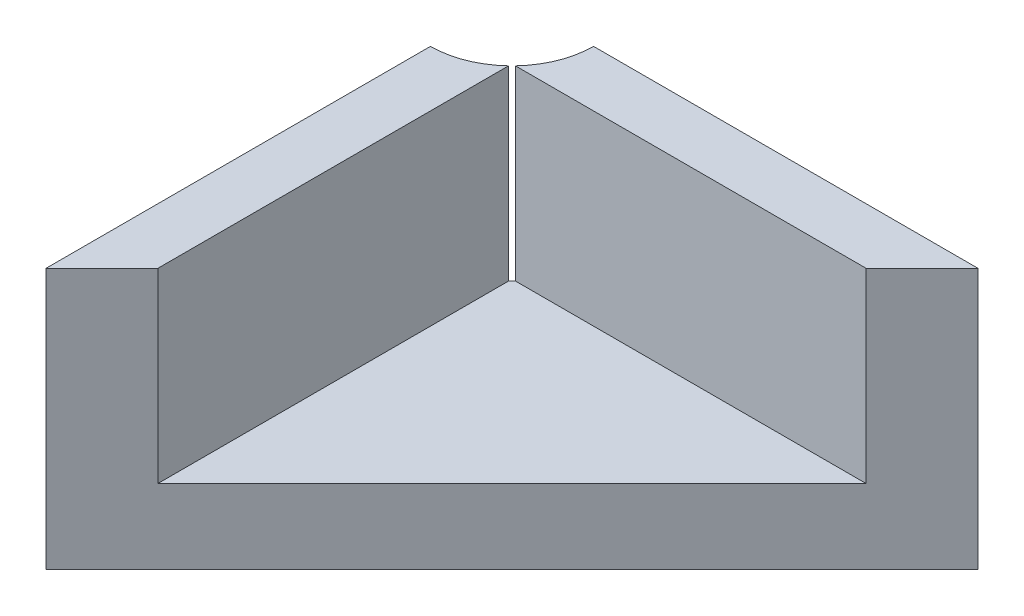
ISO-10303-21;
HEADER;
FILE_DESCRIPTION(('STEP AP214'),'2;1');
FILE_NAME('part.step','',(''),(''),'','','');
FILE_SCHEMA(('AUTOMOTIVE_DESIGN { 1 0 10303 214 1 1 1 1 }'));
ENDSEC;
DATA;
#1=APPLICATION_CONTEXT('core data for automotive mechanical design processes');
#2=APPLICATION_PROTOCOL_DEFINITION('international standard','automotive_design',2000,#1);
#3=PRODUCT_CONTEXT('',#1,'mechanical');
#4=PRODUCT('Part','Part','',(#3));
#5=PRODUCT_RELATED_PRODUCT_CATEGORY('part','',(#4));
#6=PRODUCT_DEFINITION_FORMATION('','',#4);
#7=PRODUCT_DEFINITION_CONTEXT('part definition',#1,'design');
#8=PRODUCT_DEFINITION('design','',#6,#7);
#9=PRODUCT_DEFINITION_SHAPE('','',#8);
#10=(LENGTH_UNIT() NAMED_UNIT(*) SI_UNIT(.MILLI.,.METRE.));
#11=(NAMED_UNIT(*) PLANE_ANGLE_UNIT() SI_UNIT($,.RADIAN.));
#12=(NAMED_UNIT(*) SI_UNIT($,.STERADIAN.) SOLID_ANGLE_UNIT());
#13=UNCERTAINTY_MEASURE_WITH_UNIT(LENGTH_MEASURE(1.E-05),#10,'distance_accuracy_value','');
#14=(GEOMETRIC_REPRESENTATION_CONTEXT(3) GLOBAL_UNCERTAINTY_ASSIGNED_CONTEXT((#13)) GLOBAL_UNIT_ASSIGNED_CONTEXT((#10,
#11,#12)) REPRESENTATION_CONTEXT('',''));
#15=CARTESIAN_POINT('',(0.,0.,0.));
#16=DIRECTION('',(0.,0.,1.));
#17=DIRECTION('',(1.,0.,0.));
#18=AXIS2_PLACEMENT_3D('',#15,#16,#17);
#19=CARTESIAN_POINT('',(0.,5.6,0.));
#20=DIRECTION('',(0.,1.,0.));
#21=DIRECTION('',(0.,0.,1.));
#22=AXIS2_PLACEMENT_3D('',#19,#20,#21);
#23=PLANE('',#22);
#24=CARTESIAN_POINT('',(-5.,5.6,-5.));
#25=DIRECTION('',(0.,-1.,0.));
#26=DIRECTION('',(0.,0.,-1.));
#27=AXIS2_PLACEMENT_3D('',#24,#25,#26);
#28=CIRCLE('',#27,1.75);
#29=CARTESIAN_POINT('',(-3.8,5.6,-3.7262260797143));
#30=VERTEX_POINT('',#29);
#31=CARTESIAN_POINT('',(-5.,5.6,-3.25));
#32=VERTEX_POINT('',#31);
#33=EDGE_CURVE('E135',#30,#32,#28,.T.);
#34=ORIENTED_EDGE('',*,*,#33,.T.);
#35=DIRECTION('',(0.,0.,1.));
#36=VECTOR('',#35,1.);
#37=CARTESIAN_POINT('',(-5.,5.6,-5.));
#38=LINE('',#37,#36);
#39=CARTESIAN_POINT('',(-5.,5.6,5.));
#40=VERTEX_POINT('',#39);
#41=EDGE_CURVE('E151',#32,#40,#38,.T.);
#42=ORIENTED_EDGE('',*,*,#41,.T.);
#43=DIRECTION('',(0.707106781186547,0.,-0.707106781186548));
#44=VECTOR('',#43,1.);
#45=CARTESIAN_POINT('',(5.,5.6,-5.));
#46=LINE('',#45,#44);
#47=CARTESIAN_POINT('',(-3.8,5.6,3.8));
#48=VERTEX_POINT('',#47);
#49=EDGE_CURVE('E178',#40,#48,#46,.T.);
#50=ORIENTED_EDGE('',*,*,#49,.T.);
#51=DIRECTION('',(0.,0.,1.));
#52=VECTOR('',#51,1.);
#53=CARTESIAN_POINT('',(-3.8,5.6,0.));
#54=LINE('',#53,#52);
#55=EDGE_CURVE('E174',#30,#48,#54,.T.);
#56=ORIENTED_EDGE('',*,*,#55,.F.);
#57=EDGE_LOOP('',(#34,#42,#50,#56));
#58=FACE_BOUND('',#57,.T.);
#59=ADVANCED_FACE('F61',(#58),#23,.T.);
#60=CARTESIAN_POINT('',(-5.,1.6,-5.));
#61=DIRECTION('',(1.,0.,0.));
#62=DIRECTION('',(0.,0.,-1.));
#63=AXIS2_PLACEMENT_3D('',#60,#61,#62);
#64=PLANE('',#63);
#65=ORIENTED_EDGE('',*,*,#41,.F.);
#66=DIRECTION('',(0.,-1.,0.));
#67=VECTOR('',#66,1.);
#68=CARTESIAN_POINT('',(-5.,5.6,-3.25));
#69=LINE('',#68,#67);
#70=CARTESIAN_POINT('',(-5.,0.,-3.25));
#71=VERTEX_POINT('',#70);
#72=EDGE_CURVE('E145',#32,#71,#69,.T.);
#73=ORIENTED_EDGE('',*,*,#72,.T.);
#74=DIRECTION('',(0.,0.,1.));
#75=VECTOR('',#74,1.);
#76=CARTESIAN_POINT('',(-5.,0.,-5.));
#77=LINE('',#76,#75);
#78=CARTESIAN_POINT('',(-5.,0.,5.));
#79=VERTEX_POINT('',#78);
#80=EDGE_CURVE('E150',#71,#79,#77,.T.);
#81=ORIENTED_EDGE('',*,*,#80,.T.);
#82=DIRECTION('',(0.,-1.,0.));
#83=VECTOR('',#82,1.);
#84=CARTESIAN_POINT('',(-5.,1.6,5.));
#85=LINE('',#84,#83);
#86=EDGE_CURVE('E161',#40,#79,#85,.T.);
#87=ORIENTED_EDGE('',*,*,#86,.F.);
#88=EDGE_LOOP('',(#65,#73,#81,#87));
#89=FACE_BOUND('',#88,.T.);
#90=ADVANCED_FACE('F63',(#89),#64,.F.);
#91=CARTESIAN_POINT('',(5.,1.6,-5.));
#92=DIRECTION('',(0.,0.,1.));
#93=DIRECTION('',(1.,0.,0.));
#94=AXIS2_PLACEMENT_3D('',#91,#92,#93);
#95=PLANE('',#94);
#96=DIRECTION('',(-1.,0.,0.));
#97=VECTOR('',#96,1.);
#98=CARTESIAN_POINT('',(5.,0.,-5.));
#99=LINE('',#98,#97);
#100=CARTESIAN_POINT('',(5.,0.,-5.));
#101=VERTEX_POINT('',#100);
#102=CARTESIAN_POINT('',(-3.25,0.,-5.));
#103=VERTEX_POINT('',#102);
#104=EDGE_CURVE('E144',#101,#103,#99,.T.);
#105=ORIENTED_EDGE('',*,*,#104,.T.);
#106=DIRECTION('',(0.,-1.,0.));
#107=VECTOR('',#106,1.);
#108=CARTESIAN_POINT('',(-3.25,5.6,-5.));
#109=LINE('',#108,#107);
#110=CARTESIAN_POINT('',(-3.25,5.6,-5.));
#111=VERTEX_POINT('',#110);
#112=EDGE_CURVE('E127',#103,#111,#109,.F.);
#113=ORIENTED_EDGE('',*,*,#112,.T.);
#114=DIRECTION('',(-1.,0.,0.));
#115=VECTOR('',#114,1.);
#116=CARTESIAN_POINT('',(5.,5.6,-5.));
#117=LINE('',#116,#115);
#118=CARTESIAN_POINT('',(5.,5.6,-5.));
#119=VERTEX_POINT('',#118);
#120=EDGE_CURVE('E142',#119,#111,#117,.T.);
#121=ORIENTED_EDGE('',*,*,#120,.F.);
#122=DIRECTION('',(0.,-1.,0.));
#123=VECTOR('',#122,1.);
#124=CARTESIAN_POINT('',(5.,1.6,-5.));
#125=LINE('',#124,#123);
#126=EDGE_CURVE('E159',#119,#101,#125,.T.);
#127=ORIENTED_EDGE('',*,*,#126,.T.);
#128=EDGE_LOOP('',(#105,#113,#121,#127));
#129=FACE_BOUND('',#128,.T.);
#130=ADVANCED_FACE('F140',(#129),#95,.F.);
#131=CARTESIAN_POINT('',(0.,0.,0.));
#132=DIRECTION('',(0.,-1.,0.));
#133=DIRECTION('',(0.,0.,-1.));
#134=AXIS2_PLACEMENT_3D('',#131,#132,#133);
#135=PLANE('',#134);
#136=CARTESIAN_POINT('',(-5.,0.,-5.));
#137=DIRECTION('',(0.,-1.,0.));
#138=DIRECTION('',(0.,0.,-1.));
#139=AXIS2_PLACEMENT_3D('',#136,#137,#138);
#140=CIRCLE('',#139,1.75);
#141=EDGE_CURVE('E202',#103,#71,#140,.T.);
#142=ORIENTED_EDGE('',*,*,#141,.F.);
#143=ORIENTED_EDGE('',*,*,#104,.F.);
#144=DIRECTION('',(0.707106781186547,0.,-0.707106781186548));
#145=VECTOR('',#144,1.);
#146=CARTESIAN_POINT('',(5.,0.,-5.));
#147=LINE('',#146,#145);
#148=EDGE_CURVE('E193',#79,#101,#147,.T.);
#149=ORIENTED_EDGE('',*,*,#148,.F.);
#150=ORIENTED_EDGE('',*,*,#80,.F.);
#151=EDGE_LOOP('',(#142,#143,#149,#150));
#152=FACE_BOUND('',#151,.T.);
#153=ADVANCED_FACE('F201',(#152),#135,.T.);
#154=CARTESIAN_POINT('',(-3.7262260797143,5.6,-3.8));
#155=VERTEX_POINT('',#154);
#156=EDGE_CURVE('E124',#111,#155,#28,.T.);
#157=ORIENTED_EDGE('',*,*,#156,.T.);
#158=DIRECTION('',(-1.,0.,0.));
#159=VECTOR('',#158,1.);
#160=CARTESIAN_POINT('',(0.,5.6,-3.8));
#161=LINE('',#160,#159);
#162=CARTESIAN_POINT('',(3.8,5.6,-3.8));
#163=VERTEX_POINT('',#162);
#164=EDGE_CURVE('E176',#163,#155,#161,.T.);
#165=ORIENTED_EDGE('',*,*,#164,.F.);
#166=EDGE_CURVE('E149',#163,#119,#46,.T.);
#167=ORIENTED_EDGE('',*,*,#166,.T.);
#168=ORIENTED_EDGE('',*,*,#120,.T.);
#169=EDGE_LOOP('',(#157,#165,#167,#168));
#170=FACE_BOUND('',#169,.T.);
#171=ADVANCED_FACE('F148',(#170),#23,.T.);
#172=CARTESIAN_POINT('',(-3.8,5.6,0.));
#173=DIRECTION('',(1.,0.,0.));
#174=DIRECTION('',(0.,0.,-1.));
#175=AXIS2_PLACEMENT_3D('',#172,#173,#174);
#176=PLANE('',#175);
#177=DIRECTION('',(0.,-1.,0.));
#178=VECTOR('',#177,1.);
#179=CARTESIAN_POINT('',(-3.8,5.6,-3.7262260797143));
#180=LINE('',#179,#178);
#181=CARTESIAN_POINT('',(-3.8,1.6,-3.7262260797143));
#182=VERTEX_POINT('',#181);
#183=EDGE_CURVE('E76',#30,#182,#180,.T.);
#184=ORIENTED_EDGE('',*,*,#183,.F.);
#185=ORIENTED_EDGE('',*,*,#55,.T.);
#186=DIRECTION('',(0.,-1.,0.));
#187=VECTOR('',#186,1.);
#188=CARTESIAN_POINT('',(-3.8,5.6,3.8));
#189=LINE('',#188,#187);
#190=CARTESIAN_POINT('',(-3.8,1.6,3.8));
#191=VERTEX_POINT('',#190);
#192=EDGE_CURVE('E154',#48,#191,#189,.T.);
#193=ORIENTED_EDGE('',*,*,#192,.T.);
#194=DIRECTION('',(0.,0.,1.));
#195=VECTOR('',#194,1.);
#196=CARTESIAN_POINT('',(-3.8,1.6,0.));
#197=LINE('',#196,#195);
#198=EDGE_CURVE('E169',#182,#191,#197,.T.);
#199=ORIENTED_EDGE('',*,*,#198,.F.);
#200=EDGE_LOOP('',(#184,#185,#193,#199));
#201=FACE_BOUND('',#200,.T.);
#202=ADVANCED_FACE('F183',(#201),#176,.T.);
#203=CARTESIAN_POINT('',(0.,5.6,-3.8));
#204=DIRECTION('',(0.,0.,1.));
#205=DIRECTION('',(1.,0.,0.));
#206=AXIS2_PLACEMENT_3D('',#203,#204,#205);
#207=PLANE('',#206);
#208=DIRECTION('',(0.,-1.,0.));
#209=VECTOR('',#208,1.);
#210=CARTESIAN_POINT('',(-3.7262260797143,5.6,-3.8));
#211=LINE('',#210,#209);
#212=CARTESIAN_POINT('',(-3.7262260797143,1.6,-3.8));
#213=VERTEX_POINT('',#212);
#214=EDGE_CURVE('E130',#213,#155,#211,.F.);
#215=ORIENTED_EDGE('',*,*,#214,.F.);
#216=DIRECTION('',(-1.,0.,0.));
#217=VECTOR('',#216,1.);
#218=CARTESIAN_POINT('',(0.,1.6,-3.8));
#219=LINE('',#218,#217);
#220=CARTESIAN_POINT('',(3.8,1.6,-3.8));
#221=VERTEX_POINT('',#220);
#222=EDGE_CURVE('E167',#221,#213,#219,.T.);
#223=ORIENTED_EDGE('',*,*,#222,.F.);
#224=DIRECTION('',(0.,-1.,0.));
#225=VECTOR('',#224,1.);
#226=CARTESIAN_POINT('',(3.8,5.6,-3.8));
#227=LINE('',#226,#225);
#228=EDGE_CURVE('E83',#163,#221,#227,.T.);
#229=ORIENTED_EDGE('',*,*,#228,.F.);
#230=ORIENTED_EDGE('',*,*,#164,.T.);
#231=EDGE_LOOP('',(#215,#223,#229,#230));
#232=FACE_BOUND('',#231,.T.);
#233=ADVANCED_FACE('F173',(#232),#207,.T.);
#234=CARTESIAN_POINT('',(0.,1.6,0.));
#235=DIRECTION('',(0.,-1.,0.));
#236=DIRECTION('',(0.,0.,-1.));
#237=AXIS2_PLACEMENT_3D('',#234,#235,#236);
#238=PLANE('',#237);
#239=ORIENTED_EDGE('',*,*,#222,.T.);
#240=CARTESIAN_POINT('',(-5.,1.6,-5.));
#241=DIRECTION('',(0.,-1.,0.));
#242=DIRECTION('',(0.,0.,-1.));
#243=AXIS2_PLACEMENT_3D('',#240,#241,#242);
#244=CIRCLE('',#243,1.75);
#245=EDGE_CURVE('E12',#213,#182,#244,.T.);
#246=ORIENTED_EDGE('',*,*,#245,.T.);
#247=ORIENTED_EDGE('',*,*,#198,.T.);
#248=DIRECTION('',(0.707106781186547,0.,-0.707106781186548));
#249=VECTOR('',#248,1.);
#250=CARTESIAN_POINT('',(0.,1.6,0.));
#251=LINE('',#250,#249);
#252=EDGE_CURVE('E69',#191,#221,#251,.T.);
#253=ORIENTED_EDGE('',*,*,#252,.T.);
#254=EDGE_LOOP('',(#239,#246,#247,#253));
#255=FACE_BOUND('',#254,.T.);
#256=ADVANCED_FACE('F166',(#255),#238,.F.);
#257=CARTESIAN_POINT('',(5.,5.6,-5.));
#258=DIRECTION('',(-0.707106781186548,0.,-0.707106781186547));
#259=DIRECTION('',(-0.707106781186547,0.,0.707106781186548));
#260=AXIS2_PLACEMENT_3D('',#257,#258,#259);
#261=PLANE('',#260);
#262=ORIENTED_EDGE('',*,*,#192,.F.);
#263=ORIENTED_EDGE('',*,*,#49,.F.);
#264=ORIENTED_EDGE('',*,*,#86,.T.);
#265=ORIENTED_EDGE('',*,*,#148,.T.);
#266=ORIENTED_EDGE('',*,*,#126,.F.);
#267=ORIENTED_EDGE('',*,*,#166,.F.);
#268=ORIENTED_EDGE('',*,*,#228,.T.);
#269=ORIENTED_EDGE('',*,*,#252,.F.);
#270=EDGE_LOOP('',(#262,#263,#264,#265,#266,#267,#268,#269));
#271=FACE_BOUND('',#270,.T.);
#272=ADVANCED_FACE('F187',(#271),#261,.F.);
#273=CARTESIAN_POINT('',(-5.,5.6,-5.));
#274=DIRECTION('',(0.,-1.,0.));
#275=DIRECTION('',(0.,0.,-1.));
#276=AXIS2_PLACEMENT_3D('',#273,#274,#275);
#277=CYLINDRICAL_SURFACE('',#276,1.75);
#278=ORIENTED_EDGE('',*,*,#33,.F.);
#279=ORIENTED_EDGE('',*,*,#183,.T.);
#280=ORIENTED_EDGE('',*,*,#245,.F.);
#281=ORIENTED_EDGE('',*,*,#214,.T.);
#282=ORIENTED_EDGE('',*,*,#156,.F.);
#283=ORIENTED_EDGE('',*,*,#112,.F.);
#284=ORIENTED_EDGE('',*,*,#141,.T.);
#285=ORIENTED_EDGE('',*,*,#72,.F.);
#286=EDGE_LOOP('',(#278,#279,#280,#281,#282,#283,#284,#285));
#287=FACE_BOUND('',#286,.T.);
#288=ADVANCED_FACE('F126',(#287),#277,.F.);
#289=CLOSED_SHELL('',(#59,#90,#130,#153,#171,#202,#233,#256,#272,#288));
#290=MANIFOLD_SOLID_BREP('B2',#289);
#291=ADVANCED_BREP_SHAPE_REPRESENTATION('',(#18,#290),#14);
#292=SHAPE_DEFINITION_REPRESENTATION(#9,#291);
ENDSEC;
END-ISO-10303-21;
